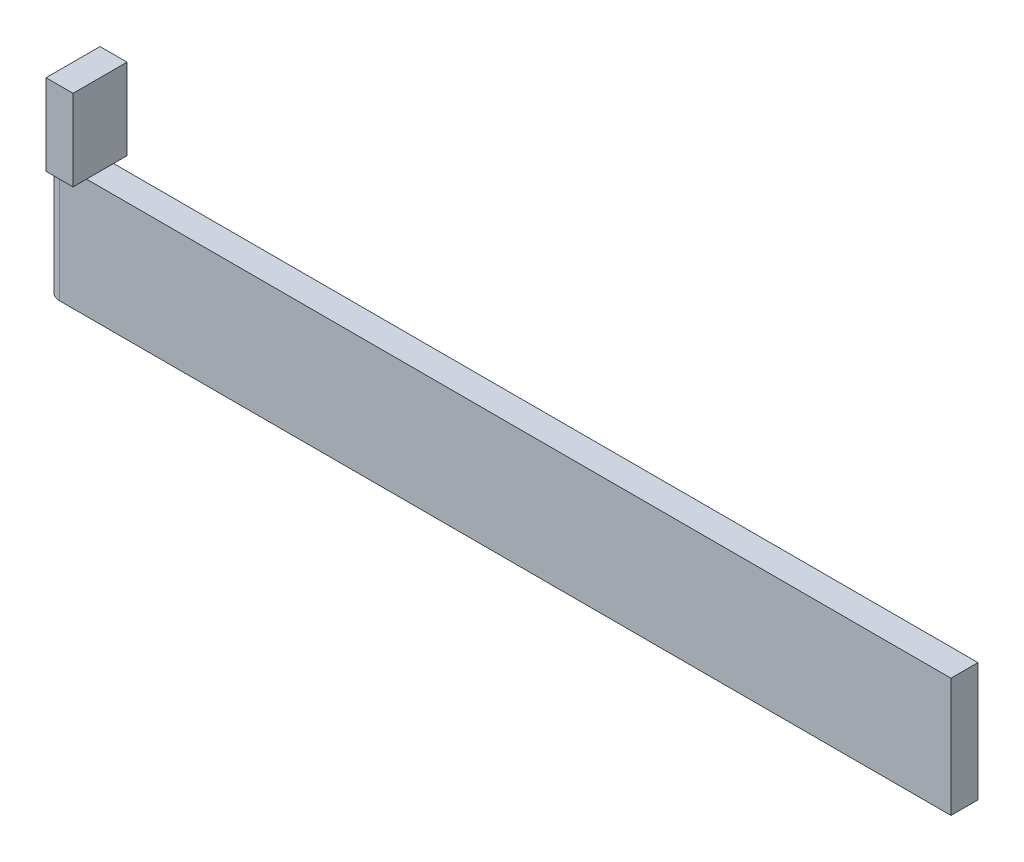
ISO-10303-21;
HEADER;
FILE_DESCRIPTION(('STEP AP214'),'2;1');
FILE_NAME('part.step','',(''),(''),'','','');
FILE_SCHEMA(('AUTOMOTIVE_DESIGN { 1 0 10303 214 1 1 1 1 }'));
ENDSEC;
DATA;
#1=APPLICATION_CONTEXT('core data for automotive mechanical design processes');
#2=APPLICATION_PROTOCOL_DEFINITION('international standard','automotive_design',2000,#1);
#3=PRODUCT_CONTEXT('',#1,'mechanical');
#4=PRODUCT('Part','Part','',(#3));
#5=PRODUCT_RELATED_PRODUCT_CATEGORY('part','',(#4));
#6=PRODUCT_DEFINITION_FORMATION('','',#4);
#7=PRODUCT_DEFINITION_CONTEXT('part definition',#1,'design');
#8=PRODUCT_DEFINITION('design','',#6,#7);
#9=PRODUCT_DEFINITION_SHAPE('','',#8);
#10=(LENGTH_UNIT() NAMED_UNIT(*) SI_UNIT(.MILLI.,.METRE.));
#11=(NAMED_UNIT(*) PLANE_ANGLE_UNIT() SI_UNIT($,.RADIAN.));
#12=(NAMED_UNIT(*) SI_UNIT($,.STERADIAN.) SOLID_ANGLE_UNIT());
#13=UNCERTAINTY_MEASURE_WITH_UNIT(LENGTH_MEASURE(1.E-05),#10,'distance_accuracy_value','');
#14=(GEOMETRIC_REPRESENTATION_CONTEXT(3) GLOBAL_UNCERTAINTY_ASSIGNED_CONTEXT((#13)) GLOBAL_UNIT_ASSIGNED_CONTEXT((#10,
#11,#12)) REPRESENTATION_CONTEXT('',''));
#15=CARTESIAN_POINT('',(0.,0.,0.));
#16=DIRECTION('',(0.,0.,1.));
#17=DIRECTION('',(1.,0.,0.));
#18=AXIS2_PLACEMENT_3D('',#15,#16,#17);
#19=CARTESIAN_POINT('',(0.,0.,5.));
#20=DIRECTION('',(1.,0.,0.));
#21=DIRECTION('',(0.,0.,-1.));
#22=AXIS2_PLACEMENT_3D('',#19,#20,#21);
#23=PLANE('',#22);
#24=DIRECTION('',(0.,0.,1.));
#25=VECTOR('',#24,1.);
#26=CARTESIAN_POINT('',(0.,22.,-2.5));
#27=LINE('',#26,#25);
#28=CARTESIAN_POINT('',(0.,22.,-2.5));
#29=VERTEX_POINT('',#28);
#30=CARTESIAN_POINT('',(0.,22.,0.));
#31=VERTEX_POINT('',#30);
#32=EDGE_CURVE('E178',#29,#31,#27,.T.);
#33=ORIENTED_EDGE('',*,*,#32,.T.);
#34=DIRECTION('',(0.,0.,1.));
#35=VECTOR('',#34,1.);
#36=CARTESIAN_POINT('',(0.,22.,5.));
#37=LINE('',#36,#35);
#38=CARTESIAN_POINT('',(0.,22.,5.));
#39=VERTEX_POINT('',#38);
#40=EDGE_CURVE('E150',#31,#39,#37,.T.);
#41=ORIENTED_EDGE('',*,*,#40,.T.);
#42=CARTESIAN_POINT('',(0.,22.,7.5));
#43=VERTEX_POINT('',#42);
#44=EDGE_CURVE('E177',#39,#43,#27,.T.);
#45=ORIENTED_EDGE('',*,*,#44,.T.);
#46=DIRECTION('',(0.,1.,0.));
#47=VECTOR('',#46,1.);
#48=CARTESIAN_POINT('',(0.,22.,7.5));
#49=LINE('',#48,#47);
#50=CARTESIAN_POINT('',(0.,37.,7.5));
#51=VERTEX_POINT('',#50);
#52=EDGE_CURVE('E182',#43,#51,#49,.T.);
#53=ORIENTED_EDGE('',*,*,#52,.T.);
#54=DIRECTION('',(0.,0.,-1.));
#55=VECTOR('',#54,1.);
#56=CARTESIAN_POINT('',(0.,37.,-2.5));
#57=LINE('',#56,#55);
#58=CARTESIAN_POINT('',(0.,37.,-2.5));
#59=VERTEX_POINT('',#58);
#60=EDGE_CURVE('E161',#51,#59,#57,.T.);
#61=ORIENTED_EDGE('',*,*,#60,.T.);
#62=DIRECTION('',(0.,-1.,0.));
#63=VECTOR('',#62,1.);
#64=CARTESIAN_POINT('',(0.,22.,-2.5));
#65=LINE('',#64,#63);
#66=EDGE_CURVE('E154',#59,#29,#65,.T.);
#67=ORIENTED_EDGE('',*,*,#66,.T.);
#68=EDGE_LOOP('',(#33,#41,#45,#53,#61,#67));
#69=FACE_BOUND('',#68,.T.);
#70=ADVANCED_FACE('F45',(#69),#23,.F.);
#71=CARTESIAN_POINT('',(0.,0.,5.));
#72=DIRECTION('',(0.,1.,0.));
#73=DIRECTION('',(0.,0.,1.));
#74=AXIS2_PLACEMENT_3D('',#71,#72,#73);
#75=PLANE('',#74);
#76=DIRECTION('',(1.,0.,0.));
#77=VECTOR('',#76,1.);
#78=CARTESIAN_POINT('',(0.,0.,5.));
#79=LINE('',#78,#77);
#80=CARTESIAN_POINT('',(0.,0.,5.));
#81=VERTEX_POINT('',#80);
#82=CARTESIAN_POINT('',(165.,0.,5.));
#83=VERTEX_POINT('',#82);
#84=EDGE_CURVE('E91',#81,#83,#79,.T.);
#85=ORIENTED_EDGE('',*,*,#84,.F.);
#86=CARTESIAN_POINT('',(0.,0.,2.5));
#87=DIRECTION('',(0.,1.,0.));
#88=DIRECTION('',(0.,0.,1.));
#89=AXIS2_PLACEMENT_3D('',#86,#87,#88);
#90=CIRCLE('',#89,2.5);
#91=CARTESIAN_POINT('',(0.,0.,0.));
#92=VERTEX_POINT('',#91);
#93=EDGE_CURVE('E142',#92,#81,#90,.T.);
#94=ORIENTED_EDGE('',*,*,#93,.F.);
#95=DIRECTION('',(1.,0.,0.));
#96=VECTOR('',#95,1.);
#97=CARTESIAN_POINT('',(0.,0.,0.));
#98=LINE('',#97,#96);
#99=CARTESIAN_POINT('',(165.,0.,0.));
#100=VERTEX_POINT('',#99);
#101=EDGE_CURVE('E128',#92,#100,#98,.T.);
#102=ORIENTED_EDGE('',*,*,#101,.T.);
#103=DIRECTION('',(0.,0.,-1.));
#104=VECTOR('',#103,1.);
#105=CARTESIAN_POINT('',(165.,0.,5.));
#106=LINE('',#105,#104);
#107=EDGE_CURVE('E48',#83,#100,#106,.T.);
#108=ORIENTED_EDGE('',*,*,#107,.F.);
#109=EDGE_LOOP('',(#85,#94,#102,#108));
#110=FACE_BOUND('',#109,.T.);
#111=ADVANCED_FACE('F148',(#110),#75,.F.);
#112=CARTESIAN_POINT('',(165.,0.,5.));
#113=DIRECTION('',(-1.,0.,0.));
#114=DIRECTION('',(0.,0.,1.));
#115=AXIS2_PLACEMENT_3D('',#112,#113,#114);
#116=PLANE('',#115);
#117=DIRECTION('',(0.,1.,0.));
#118=VECTOR('',#117,1.);
#119=CARTESIAN_POINT('',(165.,0.,0.));
#120=LINE('',#119,#118);
#121=CARTESIAN_POINT('',(165.,22.,0.));
#122=VERTEX_POINT('',#121);
#123=EDGE_CURVE('E85',#100,#122,#120,.T.);
#124=ORIENTED_EDGE('',*,*,#123,.T.);
#125=DIRECTION('',(0.,0.,-1.));
#126=VECTOR('',#125,1.);
#127=CARTESIAN_POINT('',(165.,22.,5.));
#128=LINE('',#127,#126);
#129=CARTESIAN_POINT('',(165.,22.,5.));
#130=VERTEX_POINT('',#129);
#131=EDGE_CURVE('E211',#130,#122,#128,.T.);
#132=ORIENTED_EDGE('',*,*,#131,.F.);
#133=DIRECTION('',(0.,1.,0.));
#134=VECTOR('',#133,1.);
#135=CARTESIAN_POINT('',(165.,0.,5.));
#136=LINE('',#135,#134);
#137=EDGE_CURVE('E71',#83,#130,#136,.T.);
#138=ORIENTED_EDGE('',*,*,#137,.F.);
#139=ORIENTED_EDGE('',*,*,#107,.T.);
#140=EDGE_LOOP('',(#124,#132,#138,#139));
#141=FACE_BOUND('',#140,.T.);
#142=ADVANCED_FACE('F222',(#141),#116,.F.);
#143=CARTESIAN_POINT('',(0.,22.,5.));
#144=DIRECTION('',(0.,-1.,0.));
#145=DIRECTION('',(0.,0.,-1.));
#146=AXIS2_PLACEMENT_3D('',#143,#144,#145);
#147=PLANE('',#146);
#148=DIRECTION('',(-1.,0.,0.));
#149=VECTOR('',#148,1.);
#150=CARTESIAN_POINT('',(0.,22.,0.));
#151=LINE('',#150,#149);
#152=CARTESIAN_POINT('',(5.,22.,0.));
#153=VERTEX_POINT('',#152);
#154=EDGE_CURVE('E203',#122,#153,#151,.T.);
#155=ORIENTED_EDGE('',*,*,#154,.T.);
#156=DIRECTION('',(0.,0.,1.));
#157=VECTOR('',#156,1.);
#158=CARTESIAN_POINT('',(5.,22.,-2.5));
#159=LINE('',#158,#157);
#160=CARTESIAN_POINT('',(5.,22.,5.));
#161=VERTEX_POINT('',#160);
#162=EDGE_CURVE('E11',#153,#161,#159,.T.);
#163=ORIENTED_EDGE('',*,*,#162,.T.);
#164=DIRECTION('',(-1.,0.,0.));
#165=VECTOR('',#164,1.);
#166=CARTESIAN_POINT('',(0.,22.,5.));
#167=LINE('',#166,#165);
#168=EDGE_CURVE('E209',#130,#161,#167,.T.);
#169=ORIENTED_EDGE('',*,*,#168,.F.);
#170=ORIENTED_EDGE('',*,*,#131,.T.);
#171=EDGE_LOOP('',(#155,#163,#169,#170));
#172=FACE_BOUND('',#171,.T.);
#173=ADVANCED_FACE('F223',(#172),#147,.F.);
#174=CARTESIAN_POINT('',(0.,0.,5.));
#175=DIRECTION('',(0.,0.,-1.));
#176=DIRECTION('',(-1.,0.,0.));
#177=AXIS2_PLACEMENT_3D('',#174,#175,#176);
#178=PLANE('',#177);
#179=DIRECTION('',(0.,-1.,0.));
#180=VECTOR('',#179,1.);
#181=CARTESIAN_POINT('',(0.,0.,5.));
#182=LINE('',#181,#180);
#183=EDGE_CURVE('E200',#39,#81,#182,.T.);
#184=ORIENTED_EDGE('',*,*,#183,.T.);
#185=ORIENTED_EDGE('',*,*,#84,.T.);
#186=ORIENTED_EDGE('',*,*,#137,.T.);
#187=ORIENTED_EDGE('',*,*,#168,.T.);
#188=EDGE_CURVE('E208',#161,#39,#167,.T.);
#189=ORIENTED_EDGE('',*,*,#188,.T.);
#190=EDGE_LOOP('',(#184,#185,#186,#187,#189));
#191=FACE_BOUND('',#190,.T.);
#192=ADVANCED_FACE('F225',(#191),#178,.F.);
#193=CARTESIAN_POINT('',(0.,0.,0.));
#194=DIRECTION('',(0.,0.,-1.));
#195=DIRECTION('',(-1.,0.,0.));
#196=AXIS2_PLACEMENT_3D('',#193,#194,#195);
#197=PLANE('',#196);
#198=DIRECTION('',(0.,-1.,0.));
#199=VECTOR('',#198,1.);
#200=CARTESIAN_POINT('',(0.,0.,0.));
#201=LINE('',#200,#199);
#202=EDGE_CURVE('E132',#31,#92,#201,.T.);
#203=ORIENTED_EDGE('',*,*,#202,.F.);
#204=EDGE_CURVE('E215',#153,#31,#151,.T.);
#205=ORIENTED_EDGE('',*,*,#204,.F.);
#206=ORIENTED_EDGE('',*,*,#154,.F.);
#207=ORIENTED_EDGE('',*,*,#123,.F.);
#208=ORIENTED_EDGE('',*,*,#101,.F.);
#209=EDGE_LOOP('',(#203,#205,#206,#207,#208));
#210=FACE_BOUND('',#209,.T.);
#211=ADVANCED_FACE('F130',(#210),#197,.T.);
#212=CARTESIAN_POINT('',(5.,22.,-2.5));
#213=DIRECTION('',(0.,-1.,0.));
#214=DIRECTION('',(0.,0.,-1.));
#215=AXIS2_PLACEMENT_3D('',#212,#213,#214);
#216=PLANE('',#215);
#217=ORIENTED_EDGE('',*,*,#188,.F.);
#218=CARTESIAN_POINT('',(5.,22.,7.5));
#219=VERTEX_POINT('',#218);
#220=EDGE_CURVE('E56',#161,#219,#159,.T.);
#221=ORIENTED_EDGE('',*,*,#220,.T.);
#222=DIRECTION('',(-1.,0.,0.));
#223=VECTOR('',#222,1.);
#224=CARTESIAN_POINT('',(5.,22.,7.5));
#225=LINE('',#224,#223);
#226=EDGE_CURVE('E194',#219,#43,#225,.T.);
#227=ORIENTED_EDGE('',*,*,#226,.T.);
#228=ORIENTED_EDGE('',*,*,#44,.F.);
#229=EDGE_LOOP('',(#217,#221,#227,#228));
#230=FACE_BOUND('',#229,.T.);
#231=ADVANCED_FACE('F233',(#230),#216,.T.);
#232=CARTESIAN_POINT('',(5.,22.,-2.5));
#233=DIRECTION('',(0.,0.,-1.));
#234=DIRECTION('',(-1.,0.,0.));
#235=AXIS2_PLACEMENT_3D('',#232,#233,#234);
#236=PLANE('',#235);
#237=ORIENTED_EDGE('',*,*,#66,.F.);
#238=DIRECTION('',(-1.,0.,0.));
#239=VECTOR('',#238,1.);
#240=CARTESIAN_POINT('',(5.,37.,-2.5));
#241=LINE('',#240,#239);
#242=CARTESIAN_POINT('',(5.,37.,-2.5));
#243=VERTEX_POINT('',#242);
#244=EDGE_CURVE('E146',#243,#59,#241,.T.);
#245=ORIENTED_EDGE('',*,*,#244,.F.);
#246=DIRECTION('',(0.,-1.,0.));
#247=VECTOR('',#246,1.);
#248=CARTESIAN_POINT('',(5.,22.,-2.5));
#249=LINE('',#248,#247);
#250=CARTESIAN_POINT('',(5.,22.,-2.5));
#251=VERTEX_POINT('',#250);
#252=EDGE_CURVE('E158',#243,#251,#249,.T.);
#253=ORIENTED_EDGE('',*,*,#252,.T.);
#254=DIRECTION('',(-1.,0.,0.));
#255=VECTOR('',#254,1.);
#256=CARTESIAN_POINT('',(5.,22.,-2.5));
#257=LINE('',#256,#255);
#258=EDGE_CURVE('E173',#251,#29,#257,.T.);
#259=ORIENTED_EDGE('',*,*,#258,.T.);
#260=EDGE_LOOP('',(#237,#245,#253,#259));
#261=FACE_BOUND('',#260,.T.);
#262=ADVANCED_FACE('F247',(#261),#236,.T.);
#263=CARTESIAN_POINT('',(5.,37.,-2.5));
#264=DIRECTION('',(0.,1.,0.));
#265=DIRECTION('',(0.,0.,1.));
#266=AXIS2_PLACEMENT_3D('',#263,#264,#265);
#267=PLANE('',#266);
#268=ORIENTED_EDGE('',*,*,#60,.F.);
#269=DIRECTION('',(-1.,0.,0.));
#270=VECTOR('',#269,1.);
#271=CARTESIAN_POINT('',(5.,37.,7.5));
#272=LINE('',#271,#270);
#273=CARTESIAN_POINT('',(5.,37.,7.5));
#274=VERTEX_POINT('',#273);
#275=EDGE_CURVE('E191',#274,#51,#272,.T.);
#276=ORIENTED_EDGE('',*,*,#275,.F.);
#277=DIRECTION('',(0.,0.,-1.));
#278=VECTOR('',#277,1.);
#279=CARTESIAN_POINT('',(5.,37.,-2.5));
#280=LINE('',#279,#278);
#281=EDGE_CURVE('E169',#274,#243,#280,.T.);
#282=ORIENTED_EDGE('',*,*,#281,.T.);
#283=ORIENTED_EDGE('',*,*,#244,.T.);
#284=EDGE_LOOP('',(#268,#276,#282,#283));
#285=FACE_BOUND('',#284,.T.);
#286=ADVANCED_FACE('F250',(#285),#267,.T.);
#287=CARTESIAN_POINT('',(5.,22.,7.5));
#288=DIRECTION('',(0.,0.,1.));
#289=DIRECTION('',(1.,0.,0.));
#290=AXIS2_PLACEMENT_3D('',#287,#288,#289);
#291=PLANE('',#290);
#292=ORIENTED_EDGE('',*,*,#52,.F.);
#293=ORIENTED_EDGE('',*,*,#226,.F.);
#294=DIRECTION('',(0.,1.,0.));
#295=VECTOR('',#294,1.);
#296=CARTESIAN_POINT('',(5.,22.,7.5));
#297=LINE('',#296,#295);
#298=EDGE_CURVE('E165',#219,#274,#297,.T.);
#299=ORIENTED_EDGE('',*,*,#298,.T.);
#300=ORIENTED_EDGE('',*,*,#275,.T.);
#301=EDGE_LOOP('',(#292,#293,#299,#300));
#302=FACE_BOUND('',#301,.T.);
#303=ADVANCED_FACE('F252',(#302),#291,.T.);
#304=EDGE_CURVE('E55',#251,#153,#159,.T.);
#305=ORIENTED_EDGE('',*,*,#304,.T.);
#306=ORIENTED_EDGE('',*,*,#204,.T.);
#307=ORIENTED_EDGE('',*,*,#32,.F.);
#308=ORIENTED_EDGE('',*,*,#258,.F.);
#309=EDGE_LOOP('',(#305,#306,#307,#308));
#310=FACE_BOUND('',#309,.T.);
#311=ADVANCED_FACE('F240',(#310),#216,.T.);
#312=CARTESIAN_POINT('',(5.,0.,0.));
#313=DIRECTION('',(1.,0.,0.));
#314=DIRECTION('',(0.,0.,-1.));
#315=AXIS2_PLACEMENT_3D('',#312,#313,#314);
#316=PLANE('',#315);
#317=ORIENTED_EDGE('',*,*,#252,.F.);
#318=ORIENTED_EDGE('',*,*,#281,.F.);
#319=ORIENTED_EDGE('',*,*,#298,.F.);
#320=ORIENTED_EDGE('',*,*,#220,.F.);
#321=ORIENTED_EDGE('',*,*,#162,.F.);
#322=ORIENTED_EDGE('',*,*,#304,.F.);
#323=EDGE_LOOP('',(#317,#318,#319,#320,#321,#322));
#324=FACE_BOUND('',#323,.T.);
#325=ADVANCED_FACE('F243',(#324),#316,.T.);
#326=CARTESIAN_POINT('',(0.,22.,2.5));
#327=DIRECTION('',(0.,1.,0.));
#328=DIRECTION('',(0.,0.,1.));
#329=AXIS2_PLACEMENT_3D('',#326,#327,#328);
#330=PLANE('',#329);
#331=ORIENTED_EDGE('',*,*,#40,.F.);
#332=CARTESIAN_POINT('',(0.,22.,2.5));
#333=DIRECTION('',(0.,1.,0.));
#334=DIRECTION('',(0.,0.,1.));
#335=AXIS2_PLACEMENT_3D('',#332,#333,#334);
#336=CIRCLE('',#335,2.5);
#337=EDGE_CURVE('E144',#31,#39,#336,.T.);
#338=ORIENTED_EDGE('',*,*,#337,.T.);
#339=EDGE_LOOP('',(#331,#338));
#340=FACE_BOUND('',#339,.T.);
#341=ADVANCED_FACE('F230',(#340),#330,.T.);
#342=CARTESIAN_POINT('',(0.,0.,2.5));
#343=DIRECTION('',(0.,1.,0.));
#344=DIRECTION('',(0.,0.,1.));
#345=AXIS2_PLACEMENT_3D('',#342,#343,#344);
#346=CYLINDRICAL_SURFACE('',#345,2.5);
#347=ORIENTED_EDGE('',*,*,#93,.T.);
#348=ORIENTED_EDGE('',*,*,#183,.F.);
#349=ORIENTED_EDGE('',*,*,#337,.F.);
#350=ORIENTED_EDGE('',*,*,#202,.T.);
#351=EDGE_LOOP('',(#347,#348,#349,#350));
#352=FACE_BOUND('',#351,.T.);
#353=ADVANCED_FACE('F140',(#352),#346,.T.);
#354=CLOSED_SHELL('',(#70,#111,#142,#173,#192,#211,#231,#262,#286,#303,#311,#325,#341,#353));
#355=MANIFOLD_SOLID_BREP('B2',#354);
#356=ADVANCED_BREP_SHAPE_REPRESENTATION('',(#18,#355),#14);
#357=SHAPE_DEFINITION_REPRESENTATION(#9,#356);
ENDSEC;
END-ISO-10303-21;
